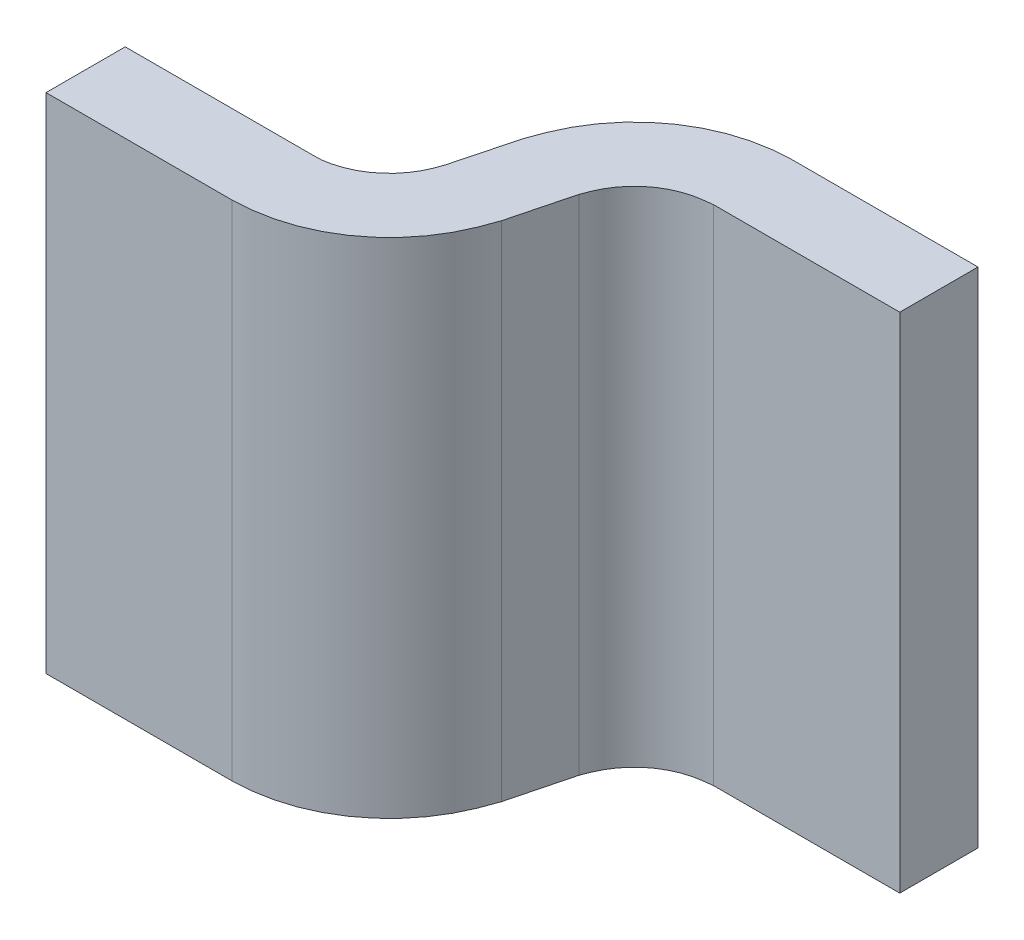
ISO-10303-21;
HEADER;
FILE_DESCRIPTION(('STEP AP214'),'2;1');
FILE_NAME('part.step','',(''),(''),'','','');
FILE_SCHEMA(('AUTOMOTIVE_DESIGN { 1 0 10303 214 1 1 1 1 }'));
ENDSEC;
DATA;
#1=APPLICATION_CONTEXT('core data for automotive mechanical design processes');
#2=APPLICATION_PROTOCOL_DEFINITION('international standard','automotive_design',2000,#1);
#3=PRODUCT_CONTEXT('',#1,'mechanical');
#4=PRODUCT('Part','Part','',(#3));
#5=PRODUCT_RELATED_PRODUCT_CATEGORY('part','',(#4));
#6=PRODUCT_DEFINITION_FORMATION('','',#4);
#7=PRODUCT_DEFINITION_CONTEXT('part definition',#1,'design');
#8=PRODUCT_DEFINITION('design','',#6,#7);
#9=PRODUCT_DEFINITION_SHAPE('','',#8);
#10=(LENGTH_UNIT() NAMED_UNIT(*) SI_UNIT(.MILLI.,.METRE.));
#11=(NAMED_UNIT(*) PLANE_ANGLE_UNIT() SI_UNIT($,.RADIAN.));
#12=(NAMED_UNIT(*) SI_UNIT($,.STERADIAN.) SOLID_ANGLE_UNIT());
#13=UNCERTAINTY_MEASURE_WITH_UNIT(LENGTH_MEASURE(1.E-05),#10,'distance_accuracy_value','');
#14=(GEOMETRIC_REPRESENTATION_CONTEXT(3) GLOBAL_UNCERTAINTY_ASSIGNED_CONTEXT((#13)) GLOBAL_UNIT_ASSIGNED_CONTEXT((#10,
#11,#12)) REPRESENTATION_CONTEXT('',''));
#15=CARTESIAN_POINT('',(0.,0.,0.));
#16=DIRECTION('',(0.,0.,1.));
#17=DIRECTION('',(1.,0.,0.));
#18=AXIS2_PLACEMENT_3D('',#15,#16,#17);
#19=CARTESIAN_POINT('',(0.876,0.254,0.238));
#20=DIRECTION('',(-1.,0.,0.));
#21=DIRECTION('',(0.,0.,1.));
#22=AXIS2_PLACEMENT_3D('',#19,#20,#21);
#23=PLANE('',#22);
#24=DIRECTION('',(0.,1.,0.));
#25=VECTOR('',#24,1.);
#26=CARTESIAN_POINT('',(0.876,-0.254,0.238));
#27=LINE('',#26,#25);
#28=CARTESIAN_POINT('',(0.876,-0.254,0.238));
#29=VERTEX_POINT('',#28);
#30=CARTESIAN_POINT('',(0.876,0.254,0.238));
#31=VERTEX_POINT('',#30);
#32=EDGE_CURVE('E11',#29,#31,#27,.T.);
#33=ORIENTED_EDGE('',*,*,#32,.F.);
#34=DIRECTION('',(0.,0.,-1.));
#35=VECTOR('',#34,1.);
#36=CARTESIAN_POINT('',(0.876,-0.254,0.318));
#37=LINE('',#36,#35);
#38=CARTESIAN_POINT('',(0.876,-0.254,0.318));
#39=VERTEX_POINT('',#38);
#40=EDGE_CURVE('E24',#39,#29,#37,.T.);
#41=ORIENTED_EDGE('',*,*,#40,.F.);
#42=DIRECTION('',(0.,-1.,0.));
#43=VECTOR('',#42,1.);
#44=CARTESIAN_POINT('',(0.876,0.254,0.318));
#45=LINE('',#44,#43);
#46=CARTESIAN_POINT('',(0.876,0.254,0.318));
#47=VERTEX_POINT('',#46);
#48=EDGE_CURVE('E439',#47,#39,#45,.T.);
#49=ORIENTED_EDGE('',*,*,#48,.F.);
#50=DIRECTION('',(0.,0.,1.));
#51=VECTOR('',#50,1.);
#52=CARTESIAN_POINT('',(0.876,0.254,0.238));
#53=LINE('',#52,#51);
#54=EDGE_CURVE('E437',#31,#47,#53,.T.);
#55=ORIENTED_EDGE('',*,*,#54,.F.);
#56=EDGE_LOOP('',(#33,#41,#49,#55));
#57=FACE_BOUND('',#56,.T.);
#58=ADVANCED_FACE('F17',(#57),#23,.T.);
#59=CARTESIAN_POINT('',(0.876,0.254,0.318));
#60=DIRECTION('',(0.,0.,1.));
#61=DIRECTION('',(0.,1.,0.));
#62=AXIS2_PLACEMENT_3D('',#59,#60,#61);
#63=PLANE('',#62);
#64=ORIENTED_EDGE('',*,*,#48,.T.);
#65=DIRECTION('',(-1.,0.,0.));
#66=VECTOR('',#65,1.);
#67=CARTESIAN_POINT('',(1.064,-0.254,0.318));
#68=LINE('',#67,#66);
#69=CARTESIAN_POINT('',(1.064,-0.254,0.318));
#70=VERTEX_POINT('',#69);
#71=EDGE_CURVE('E435',#70,#39,#68,.T.);
#72=ORIENTED_EDGE('',*,*,#71,.F.);
#73=CARTESIAN_POINT('',(1.064,0.254,0.31775));
#74=DIRECTION('',(0.,-1.,0.));
#75=VECTOR('',#74,1.);
#76=LINE('',#73,#75);
#77=CARTESIAN_POINT('',(1.064,0.254,0.318));
#78=VERTEX_POINT('',#77);
#79=EDGE_CURVE('E257',#78,#70,#76,.T.);
#80=ORIENTED_EDGE('',*,*,#79,.F.);
#81=DIRECTION('',(1.,0.,0.));
#82=VECTOR('',#81,1.);
#83=CARTESIAN_POINT('',(0.876,0.254,0.318));
#84=LINE('',#83,#82);
#85=EDGE_CURVE('E247',#47,#78,#84,.T.);
#86=ORIENTED_EDGE('',*,*,#85,.F.);
#87=EDGE_LOOP('',(#64,#72,#80,#86));
#88=FACE_BOUND('',#87,.T.);
#89=ADVANCED_FACE('F237',(#88),#63,.T.);
#90=CARTESIAN_POINT('',(0.876,-0.254,0.238));
#91=DIRECTION('',(0.,0.,-1.));
#92=DIRECTION('',(0.,1.,0.));
#93=AXIS2_PLACEMENT_3D('',#90,#91,#92);
#94=PLANE('',#93);
#95=ORIENTED_EDGE('',*,*,#32,.T.);
#96=DIRECTION('',(-1.,0.,0.));
#97=VECTOR('',#96,1.);
#98=CARTESIAN_POINT('',(1.064,0.254,0.238));
#99=LINE('',#98,#97);
#100=CARTESIAN_POINT('',(1.064,0.254,0.238));
#101=VERTEX_POINT('',#100);
#102=EDGE_CURVE('E443',#101,#31,#99,.T.);
#103=ORIENTED_EDGE('',*,*,#102,.F.);
#104=CARTESIAN_POINT('',(1.064,-0.254,0.238375));
#105=DIRECTION('',(0.,1.,0.));
#106=VECTOR('',#105,1.);
#107=LINE('',#104,#106);
#108=CARTESIAN_POINT('',(1.064,-0.254,0.238));
#109=VERTEX_POINT('',#108);
#110=EDGE_CURVE('E222',#109,#101,#107,.T.);
#111=ORIENTED_EDGE('',*,*,#110,.F.);
#112=DIRECTION('',(1.,0.,0.));
#113=VECTOR('',#112,1.);
#114=CARTESIAN_POINT('',(0.876,-0.254,0.238));
#115=LINE('',#114,#113);
#116=EDGE_CURVE('E219',#29,#109,#115,.T.);
#117=ORIENTED_EDGE('',*,*,#116,.F.);
#118=EDGE_LOOP('',(#95,#103,#111,#117));
#119=FACE_BOUND('',#118,.T.);
#120=ADVANCED_FACE('F228',(#119),#94,.T.);
#121=CARTESIAN_POINT('',(1.234,-0.254,0.138));
#122=DIRECTION('',(0.965885549343203,0.,0.258969313954337));
#123=DIRECTION('',(-0.258969313954337,0.,0.965885549343203));
#124=AXIS2_PLACEMENT_3D('',#121,#122,#123);
#125=PLANE('',#124);
#126=CARTESIAN_POINT('',(1.23442187168926,0.254,0.138115055915251));
#127=DIRECTION('',(0.,-1.,0.));
#128=VECTOR('',#127,1.);
#129=LINE('',#126,#128);
#130=CARTESIAN_POINT('',(1.234,0.254,0.138));
#131=VERTEX_POINT('',#130);
#132=CARTESIAN_POINT('',(1.234,-0.254,0.138));
#133=VERTEX_POINT('',#132);
#134=EDGE_CURVE('E215',#131,#133,#129,.T.);
#135=ORIENTED_EDGE('',*,*,#134,.F.);
#136=CARTESIAN_POINT('',(1.218,0.254,0.2));
#137=DIRECTION('',(0.258969313954338,0.,-0.965885549343202));
#138=VECTOR('',#137,1.);
#139=LINE('',#136,#138);
#140=CARTESIAN_POINT('',(1.218,0.254,0.2));
#141=VERTEX_POINT('',#140);
#142=EDGE_CURVE('E301',#141,#131,#139,.T.);
#143=ORIENTED_EDGE('',*,*,#142,.F.);
#144=CARTESIAN_POINT('',(1.21740631765688,-0.254,0.199841941713844));
#145=DIRECTION('',(0.,1.,0.));
#146=VECTOR('',#145,1.);
#147=LINE('',#144,#146);
#148=CARTESIAN_POINT('',(1.218,-0.254,0.2));
#149=VERTEX_POINT('',#148);
#150=EDGE_CURVE('E288',#149,#141,#147,.T.);
#151=ORIENTED_EDGE('',*,*,#150,.F.);
#152=DIRECTION('',(-0.258969313954337,0.,0.965885549343202));
#153=VECTOR('',#152,1.);
#154=CARTESIAN_POINT('',(1.234,-0.254,0.138));
#155=LINE('',#154,#153);
#156=EDGE_CURVE('E356',#133,#149,#155,.T.);
#157=ORIENTED_EDGE('',*,*,#156,.F.);
#158=EDGE_LOOP('',(#135,#143,#151,#157));
#159=FACE_BOUND('',#158,.T.);
#160=ADVANCED_FACE('F236',(#159),#125,.T.);
#161=CARTESIAN_POINT('',(1.157,0.254,0.118));
#162=DIRECTION('',(-0.965885549343203,0.,-0.258969313954337));
#163=DIRECTION('',(-0.258969313954337,0.,0.965885549343203));
#164=AXIS2_PLACEMENT_3D('',#161,#162,#163);
#165=PLANE('',#164);
#166=CARTESIAN_POINT('',(1.15759368234312,-0.254,0.118158058286156));
#167=DIRECTION('',(0.,1.,0.));
#168=VECTOR('',#167,1.);
#169=LINE('',#166,#168);
#170=CARTESIAN_POINT('',(1.157,-0.254,0.118));
#171=VERTEX_POINT('',#170);
#172=CARTESIAN_POINT('',(1.157,0.254,0.118));
#173=VERTEX_POINT('',#172);
#174=EDGE_CURVE('E342',#171,#173,#169,.T.);
#175=ORIENTED_EDGE('',*,*,#174,.F.);
#176=CARTESIAN_POINT('',(1.141,-0.254,0.179));
#177=DIRECTION('',(0.258969313954335,0.,-0.965885549343203));
#178=VECTOR('',#177,1.);
#179=LINE('',#176,#178);
#180=CARTESIAN_POINT('',(1.141,-0.254,0.179));
#181=VERTEX_POINT('',#180);
#182=EDGE_CURVE('E330',#181,#171,#179,.T.);
#183=ORIENTED_EDGE('',*,*,#182,.F.);
#184=CARTESIAN_POINT('',(1.14082576891933,0.254,0.178954745173853));
#185=DIRECTION('',(0.,-1.,0.));
#186=VECTOR('',#185,1.);
#187=LINE('',#184,#186);
#188=CARTESIAN_POINT('',(1.141,0.254,0.179));
#189=VERTEX_POINT('',#188);
#190=EDGE_CURVE('E366',#189,#181,#187,.T.);
#191=ORIENTED_EDGE('',*,*,#190,.F.);
#192=DIRECTION('',(-0.258969313954337,0.,0.965885549343203));
#193=VECTOR('',#192,1.);
#194=CARTESIAN_POINT('',(1.157,0.254,0.118));
#195=LINE('',#194,#193);
#196=EDGE_CURVE('E368',#173,#189,#195,.T.);
#197=ORIENTED_EDGE('',*,*,#196,.F.);
#198=EDGE_LOOP('',(#175,#183,#191,#197));
#199=FACE_BOUND('',#198,.T.);
#200=ADVANCED_FACE('F160',(#199),#165,.T.);
#201=CARTESIAN_POINT('',(1.499,-0.254,0.079));
#202=DIRECTION('',(0.,0.,1.));
#203=DIRECTION('',(0.,1.,0.));
#204=AXIS2_PLACEMENT_3D('',#201,#202,#203);
#205=PLANE('',#204);
#206=DIRECTION('',(0.,-1.,0.));
#207=VECTOR('',#206,1.);
#208=CARTESIAN_POINT('',(1.499,0.254,0.079));
#209=LINE('',#208,#207);
#210=CARTESIAN_POINT('',(1.499,0.254,0.079));
#211=VERTEX_POINT('',#210);
#212=CARTESIAN_POINT('',(1.499,-0.254,0.079));
#213=VERTEX_POINT('',#212);
#214=EDGE_CURVE('E125',#211,#213,#209,.T.);
#215=ORIENTED_EDGE('',*,*,#214,.F.);
#216=DIRECTION('',(1.,0.,0.));
#217=VECTOR('',#216,1.);
#218=CARTESIAN_POINT('',(1.311,0.254,0.079));
#219=LINE('',#218,#217);
#220=CARTESIAN_POINT('',(1.311,0.254,0.079));
#221=VERTEX_POINT('',#220);
#222=EDGE_CURVE('E377',#221,#211,#219,.T.);
#223=ORIENTED_EDGE('',*,*,#222,.F.);
#224=CARTESIAN_POINT('',(1.311,-0.254,0.079625));
#225=DIRECTION('',(0.,1.,0.));
#226=VECTOR('',#225,1.);
#227=LINE('',#224,#226);
#228=CARTESIAN_POINT('',(1.311,-0.254,0.079));
#229=VERTEX_POINT('',#228);
#230=EDGE_CURVE('E178',#229,#221,#227,.T.);
#231=ORIENTED_EDGE('',*,*,#230,.F.);
#232=DIRECTION('',(-1.,0.,0.));
#233=VECTOR('',#232,1.);
#234=CARTESIAN_POINT('',(1.499,-0.254,0.079));
#235=LINE('',#234,#233);
#236=EDGE_CURVE('E169',#213,#229,#235,.T.);
#237=ORIENTED_EDGE('',*,*,#236,.F.);
#238=EDGE_LOOP('',(#215,#223,#231,#237));
#239=FACE_BOUND('',#238,.T.);
#240=ADVANCED_FACE('F155',(#239),#205,.T.);
#241=CARTESIAN_POINT('',(1.311,-0.254,0.));
#242=DIRECTION('',(0.,0.,-1.));
#243=DIRECTION('',(0.,1.,0.));
#244=AXIS2_PLACEMENT_3D('',#241,#242,#243);
#245=PLANE('',#244);
#246=CARTESIAN_POINT('',(1.311,0.254,0.000249999999999979));
#247=DIRECTION('',(0.,-1.,0.));
#248=VECTOR('',#247,1.);
#249=LINE('',#246,#248);
#250=CARTESIAN_POINT('',(1.311,0.254,0.));
#251=VERTEX_POINT('',#250);
#252=CARTESIAN_POINT('',(1.311,-0.254,0.));
#253=VERTEX_POINT('',#252);
#254=EDGE_CURVE('E140',#251,#253,#249,.T.);
#255=ORIENTED_EDGE('',*,*,#254,.F.);
#256=DIRECTION('',(-1.,0.,0.));
#257=VECTOR('',#256,1.);
#258=CARTESIAN_POINT('',(1.499,0.254,0.));
#259=LINE('',#258,#257);
#260=CARTESIAN_POINT('',(1.499,0.254,0.));
#261=VERTEX_POINT('',#260);
#262=EDGE_CURVE('E107',#261,#251,#259,.T.);
#263=ORIENTED_EDGE('',*,*,#262,.F.);
#264=DIRECTION('',(0.,1.,0.));
#265=VECTOR('',#264,1.);
#266=CARTESIAN_POINT('',(1.499,-0.254,0.));
#267=LINE('',#266,#265);
#268=CARTESIAN_POINT('',(1.499,-0.254,0.));
#269=VERTEX_POINT('',#268);
#270=EDGE_CURVE('E101',#269,#261,#267,.T.);
#271=ORIENTED_EDGE('',*,*,#270,.F.);
#272=DIRECTION('',(1.,0.,0.));
#273=VECTOR('',#272,1.);
#274=CARTESIAN_POINT('',(1.311,-0.254,0.));
#275=LINE('',#274,#273);
#276=EDGE_CURVE('E104',#253,#269,#275,.T.);
#277=ORIENTED_EDGE('',*,*,#276,.F.);
#278=EDGE_LOOP('',(#255,#263,#271,#277));
#279=FACE_BOUND('',#278,.T.);
#280=ADVANCED_FACE('F103',(#279),#245,.T.);
#281=CARTESIAN_POINT('',(1.499,-0.254,0.));
#282=DIRECTION('',(1.,0.,0.));
#283=DIRECTION('',(0.,0.,1.));
#284=AXIS2_PLACEMENT_3D('',#281,#282,#283);
#285=PLANE('',#284);
#286=ORIENTED_EDGE('',*,*,#270,.T.);
#287=DIRECTION('',(0.,0.,-1.));
#288=VECTOR('',#287,1.);
#289=CARTESIAN_POINT('',(1.499,0.254,0.079));
#290=LINE('',#289,#288);
#291=EDGE_CURVE('E122',#211,#261,#290,.T.);
#292=ORIENTED_EDGE('',*,*,#291,.F.);
#293=ORIENTED_EDGE('',*,*,#214,.T.);
#294=DIRECTION('',(0.,0.,1.));
#295=VECTOR('',#294,1.);
#296=CARTESIAN_POINT('',(1.499,-0.254,0.));
#297=LINE('',#296,#295);
#298=EDGE_CURVE('E118',#269,#213,#297,.T.);
#299=ORIENTED_EDGE('',*,*,#298,.F.);
#300=EDGE_LOOP('',(#286,#292,#293,#299));
#301=FACE_BOUND('',#300,.T.);
#302=ADVANCED_FACE('F124',(#301),#285,.T.);
#303=CARTESIAN_POINT('',(1.064,0.254,0.159));
#304=DIRECTION('',(0.,1.,0.));
#305=DIRECTION('',(0.,0.,1.));
#306=AXIS2_PLACEMENT_3D('',#303,#304,#305);
#307=CYLINDRICAL_SURFACE('',#306,0.15875);
#308=ORIENTED_EDGE('',*,*,#79,.T.);
#309=CARTESIAN_POINT('',(1.064,-0.254,0.159));
#310=DIRECTION('',(0.,-1.,0.));
#311=DIRECTION('',(-0.793107076683516,0.,0.609082231652284));
#312=AXIS2_PLACEMENT_3D('',#309,#310,#311);
#313=CIRCLE('',#312,0.15875);
#314=EDGE_CURVE('E127',#149,#70,#313,.T.);
#315=ORIENTED_EDGE('',*,*,#314,.F.);
#316=ORIENTED_EDGE('',*,*,#150,.T.);
#317=CARTESIAN_POINT('',(1.064,0.254,0.159));
#318=DIRECTION('',(0.,1.,0.));
#319=DIRECTION('',(0.793107076683516,0.,-0.609082231652284));
#320=AXIS2_PLACEMENT_3D('',#317,#318,#319);
#321=CIRCLE('',#320,0.15875);
#322=EDGE_CURVE('E131',#78,#141,#321,.T.);
#323=ORIENTED_EDGE('',*,*,#322,.F.);
#324=EDGE_LOOP('',(#308,#315,#316,#323));
#325=FACE_BOUND('',#324,.T.);
#326=ADVANCED_FACE('F263',(#325),#307,.T.);
#327=CARTESIAN_POINT('',(1.064,-0.254,0.159));
#328=DIRECTION('',(0.,1.,0.));
#329=DIRECTION('',(0.,0.,-1.));
#330=AXIS2_PLACEMENT_3D('',#327,#328,#329);
#331=CYLINDRICAL_SURFACE('',#330,0.079375);
#332=ORIENTED_EDGE('',*,*,#110,.T.);
#333=CARTESIAN_POINT('',(1.064,0.254,0.159));
#334=DIRECTION('',(0.,-1.,0.));
#335=DIRECTION('',(-0.793107076683516,0.,0.609082231652284));
#336=AXIS2_PLACEMENT_3D('',#333,#334,#335);
#337=CIRCLE('',#336,0.079375);
#338=EDGE_CURVE('E427',#189,#101,#337,.T.);
#339=ORIENTED_EDGE('',*,*,#338,.F.);
#340=ORIENTED_EDGE('',*,*,#190,.T.);
#341=CARTESIAN_POINT('',(1.064,-0.254,0.159));
#342=DIRECTION('',(0.,1.,0.));
#343=DIRECTION('',(0.793107076683516,0.,-0.609082231652284));
#344=AXIS2_PLACEMENT_3D('',#341,#342,#343);
#345=CIRCLE('',#344,0.079375);
#346=EDGE_CURVE('E423',#109,#181,#345,.T.);
#347=ORIENTED_EDGE('',*,*,#346,.F.);
#348=EDGE_LOOP('',(#332,#339,#340,#347));
#349=FACE_BOUND('',#348,.T.);
#350=ADVANCED_FACE('F195',(#349),#331,.F.);
#351=CARTESIAN_POINT('',(1.311,-0.254,0.159));
#352=DIRECTION('',(0.,1.,0.));
#353=DIRECTION('',(0.,0.,1.));
#354=AXIS2_PLACEMENT_3D('',#351,#352,#353);
#355=CYLINDRICAL_SURFACE('',#354,0.079375);
#356=ORIENTED_EDGE('',*,*,#230,.T.);
#357=CARTESIAN_POINT('',(1.311,0.254,0.159));
#358=DIRECTION('',(0.,-1.,0.));
#359=DIRECTION('',(0.793107076683516,0.,-0.609082231652284));
#360=AXIS2_PLACEMENT_3D('',#357,#358,#359);
#361=CIRCLE('',#360,0.079375);
#362=EDGE_CURVE('E418',#131,#221,#361,.T.);
#363=ORIENTED_EDGE('',*,*,#362,.F.);
#364=ORIENTED_EDGE('',*,*,#134,.T.);
#365=CARTESIAN_POINT('',(1.311,-0.254,0.159));
#366=DIRECTION('',(0.,1.,0.));
#367=DIRECTION('',(-0.793107076683516,0.,0.609082231652284));
#368=AXIS2_PLACEMENT_3D('',#365,#366,#367);
#369=CIRCLE('',#368,0.079375);
#370=EDGE_CURVE('E408',#229,#133,#369,.T.);
#371=ORIENTED_EDGE('',*,*,#370,.F.);
#372=EDGE_LOOP('',(#356,#363,#364,#371));
#373=FACE_BOUND('',#372,.T.);
#374=ADVANCED_FACE('F184',(#373),#355,.F.);
#375=CARTESIAN_POINT('',(1.311,-0.254,0.159));
#376=DIRECTION('',(0.,1.,0.));
#377=DIRECTION('',(0.,0.,-1.));
#378=AXIS2_PLACEMENT_3D('',#375,#376,#377);
#379=CYLINDRICAL_SURFACE('',#378,0.15875);
#380=ORIENTED_EDGE('',*,*,#254,.T.);
#381=CARTESIAN_POINT('',(1.311,-0.254,0.159));
#382=DIRECTION('',(0.,-1.,0.));
#383=DIRECTION('',(0.793107076683516,0.,-0.609082231652284));
#384=AXIS2_PLACEMENT_3D('',#381,#382,#383);
#385=CIRCLE('',#384,0.15875);
#386=EDGE_CURVE('E121',#171,#253,#385,.T.);
#387=ORIENTED_EDGE('',*,*,#386,.F.);
#388=ORIENTED_EDGE('',*,*,#174,.T.);
#389=CARTESIAN_POINT('',(1.311,0.254,0.159));
#390=DIRECTION('',(0.,1.,0.));
#391=DIRECTION('',(-0.793107076683516,0.,0.609082231652284));
#392=AXIS2_PLACEMENT_3D('',#389,#390,#391);
#393=CIRCLE('',#392,0.15875);
#394=EDGE_CURVE('E405',#251,#173,#393,.T.);
#395=ORIENTED_EDGE('',*,*,#394,.F.);
#396=EDGE_LOOP('',(#380,#387,#388,#395));
#397=FACE_BOUND('',#396,.T.);
#398=ADVANCED_FACE('F194',(#397),#379,.T.);
#399=CARTESIAN_POINT('',(0.876,-0.254,0.238));
#400=DIRECTION('',(0.,-1.,0.));
#401=DIRECTION('',(1.,0.,0.));
#402=AXIS2_PLACEMENT_3D('',#399,#400,#401);
#403=PLANE('',#402);
#404=ORIENTED_EDGE('',*,*,#71,.T.);
#405=ORIENTED_EDGE('',*,*,#40,.T.);
#406=ORIENTED_EDGE('',*,*,#116,.T.);
#407=ORIENTED_EDGE('',*,*,#346,.T.);
#408=ORIENTED_EDGE('',*,*,#182,.T.);
#409=ORIENTED_EDGE('',*,*,#386,.T.);
#410=ORIENTED_EDGE('',*,*,#276,.T.);
#411=ORIENTED_EDGE('',*,*,#298,.T.);
#412=ORIENTED_EDGE('',*,*,#236,.T.);
#413=ORIENTED_EDGE('',*,*,#370,.T.);
#414=ORIENTED_EDGE('',*,*,#156,.T.);
#415=ORIENTED_EDGE('',*,*,#314,.T.);
#416=EDGE_LOOP('',(#404,#405,#406,#407,#408,#409,#410,#411,#412,#413,#414,#415));
#417=FACE_BOUND('',#416,.T.);
#418=ADVANCED_FACE('F116',(#417),#403,.T.);
#419=CARTESIAN_POINT('',(1.311,0.254,0.079));
#420=DIRECTION('',(0.,1.,0.));
#421=DIRECTION('',(1.,0.,0.));
#422=AXIS2_PLACEMENT_3D('',#419,#420,#421);
#423=PLANE('',#422);
#424=ORIENTED_EDGE('',*,*,#102,.T.);
#425=ORIENTED_EDGE('',*,*,#54,.T.);
#426=ORIENTED_EDGE('',*,*,#85,.T.);
#427=ORIENTED_EDGE('',*,*,#322,.T.);
#428=ORIENTED_EDGE('',*,*,#142,.T.);
#429=ORIENTED_EDGE('',*,*,#362,.T.);
#430=ORIENTED_EDGE('',*,*,#222,.T.);
#431=ORIENTED_EDGE('',*,*,#291,.T.);
#432=ORIENTED_EDGE('',*,*,#262,.T.);
#433=ORIENTED_EDGE('',*,*,#394,.T.);
#434=ORIENTED_EDGE('',*,*,#196,.T.);
#435=ORIENTED_EDGE('',*,*,#338,.T.);
#436=EDGE_LOOP('',(#424,#425,#426,#427,#428,#429,#430,#431,#432,#433,#434,#435));
#437=FACE_BOUND('',#436,.T.);
#438=ADVANCED_FACE('F306',(#437),#423,.T.);
#439=CLOSED_SHELL('',(#58,#89,#120,#160,#200,#240,#280,#302,#326,#350,#374,#398,#418,#438));
#440=MANIFOLD_SOLID_BREP('B1',#439);
#441=ADVANCED_BREP_SHAPE_REPRESENTATION('',(#18,#440),#14);
#442=SHAPE_DEFINITION_REPRESENTATION(#9,#441);
ENDSEC;
END-ISO-10303-21;
